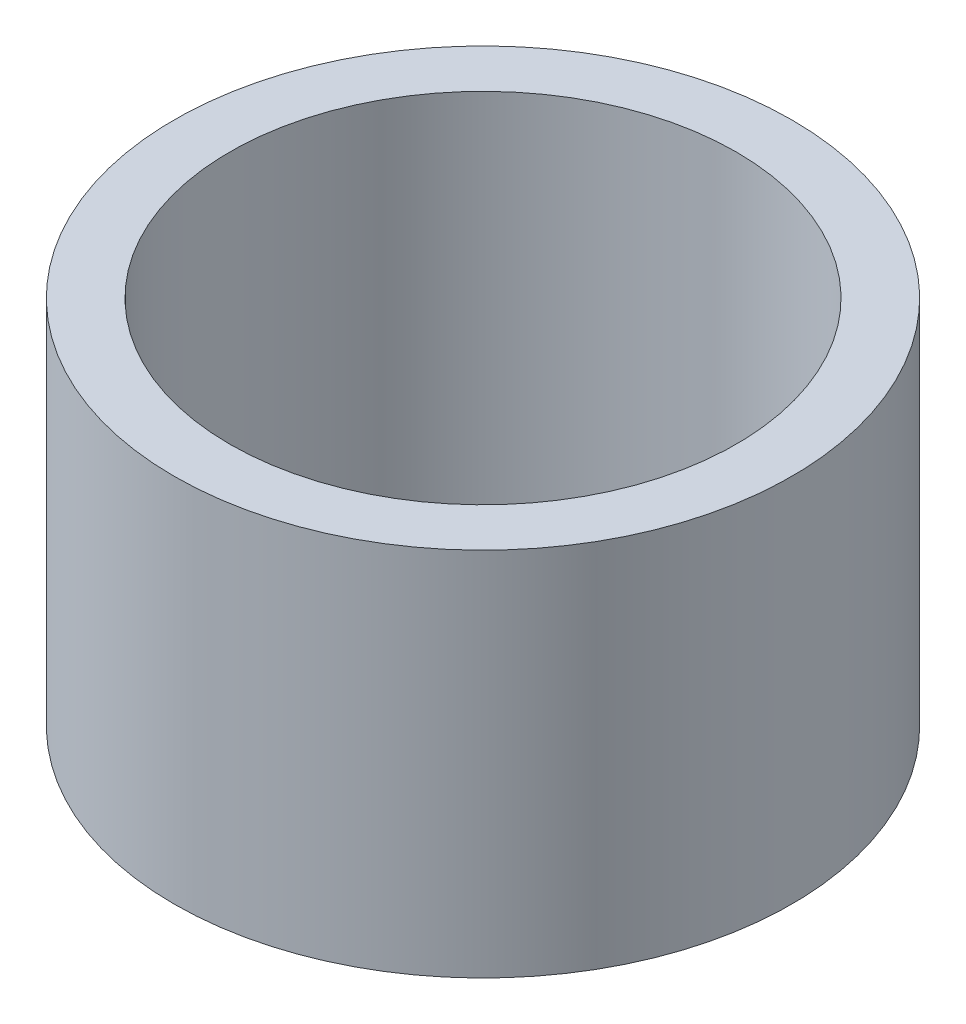
ISO-10303-21;
HEADER;
FILE_DESCRIPTION(('STEP AP214'),'2;1');
FILE_NAME('part.step','',(''),(''),'','','');
FILE_SCHEMA(('AUTOMOTIVE_DESIGN { 1 0 10303 214 1 1 1 1 }'));
ENDSEC;
DATA;
#1=APPLICATION_CONTEXT('core data for automotive mechanical design processes');
#2=APPLICATION_PROTOCOL_DEFINITION('international standard','automotive_design',2000,#1);
#3=PRODUCT_CONTEXT('',#1,'mechanical');
#4=PRODUCT('Part','Part','',(#3));
#5=PRODUCT_RELATED_PRODUCT_CATEGORY('part','',(#4));
#6=PRODUCT_DEFINITION_FORMATION('','',#4);
#7=PRODUCT_DEFINITION_CONTEXT('part definition',#1,'design');
#8=PRODUCT_DEFINITION('design','',#6,#7);
#9=PRODUCT_DEFINITION_SHAPE('','',#8);
#10=(LENGTH_UNIT() NAMED_UNIT(*) SI_UNIT(.MILLI.,.METRE.));
#11=(NAMED_UNIT(*) PLANE_ANGLE_UNIT() SI_UNIT($,.RADIAN.));
#12=(NAMED_UNIT(*) SI_UNIT($,.STERADIAN.) SOLID_ANGLE_UNIT());
#13=UNCERTAINTY_MEASURE_WITH_UNIT(LENGTH_MEASURE(1.E-05),#10,'distance_accuracy_value','');
#14=(GEOMETRIC_REPRESENTATION_CONTEXT(3) GLOBAL_UNCERTAINTY_ASSIGNED_CONTEXT((#13)) GLOBAL_UNIT_ASSIGNED_CONTEXT((#10,
#11,#12)) REPRESENTATION_CONTEXT('',''));
#15=CARTESIAN_POINT('',(0.,0.,0.));
#16=DIRECTION('',(0.,0.,1.));
#17=DIRECTION('',(1.,0.,0.));
#18=AXIS2_PLACEMENT_3D('',#15,#16,#17);
#19=CARTESIAN_POINT('',(0.,3.,0.));
#20=DIRECTION('',(0.,-1.,0.));
#21=DIRECTION('',(0.,0.,-1.));
#22=AXIS2_PLACEMENT_3D('',#19,#20,#21);
#23=CYLINDRICAL_SURFACE('',#22,2.5);
#24=CARTESIAN_POINT('',(0.,3.,0.));
#25=DIRECTION('',(0.,1.,0.));
#26=DIRECTION('',(0.,0.,1.));
#27=AXIS2_PLACEMENT_3D('',#24,#25,#26);
#28=CIRCLE('',#27,2.5);
#29=CARTESIAN_POINT('',(0.,3.,2.5));
#30=VERTEX_POINT('',#29);
#31=EDGE_CURVE('E10',#30,#30,#28,.T.);
#32=ORIENTED_EDGE('',*,*,#31,.F.);
#33=EDGE_LOOP('',(#32));
#34=FACE_BOUND('',#33,.T.);
#35=CARTESIAN_POINT('',(0.,0.,0.));
#36=DIRECTION('',(0.,1.,0.));
#37=DIRECTION('',(0.,0.,1.));
#38=AXIS2_PLACEMENT_3D('',#35,#36,#37);
#39=CIRCLE('',#38,2.5);
#40=CARTESIAN_POINT('',(0.,0.,2.5));
#41=VERTEX_POINT('',#40);
#42=EDGE_CURVE('E45',#41,#41,#39,.T.);
#43=ORIENTED_EDGE('',*,*,#42,.T.);
#44=EDGE_LOOP('',(#43));
#45=FACE_BOUND('',#44,.T.);
#46=ADVANCED_FACE('F37',(#34,#45),#23,.T.);
#47=CARTESIAN_POINT('',(0.,3.,0.));
#48=DIRECTION('',(0.,1.,0.));
#49=DIRECTION('',(0.,0.,1.));
#50=AXIS2_PLACEMENT_3D('',#47,#48,#49);
#51=PLANE('',#50);
#52=CARTESIAN_POINT('',(0.,3.,0.));
#53=DIRECTION('',(0.,1.,0.));
#54=DIRECTION('',(0.,0.,1.));
#55=AXIS2_PLACEMENT_3D('',#52,#53,#54);
#56=CIRCLE('',#55,2.05);
#57=CARTESIAN_POINT('',(0.,3.,2.05));
#58=VERTEX_POINT('',#57);
#59=EDGE_CURVE('E52',#58,#58,#56,.T.);
#60=ORIENTED_EDGE('',*,*,#59,.F.);
#61=EDGE_LOOP('',(#60));
#62=FACE_BOUND('',#61,.T.);
#63=ORIENTED_EDGE('',*,*,#31,.T.);
#64=EDGE_LOOP('',(#63));
#65=FACE_BOUND('',#64,.T.);
#66=ADVANCED_FACE('F70',(#62,#65),#51,.T.);
#67=CARTESIAN_POINT('',(0.,0.,0.));
#68=DIRECTION('',(0.,1.,0.));
#69=DIRECTION('',(0.,0.,1.));
#70=AXIS2_PLACEMENT_3D('',#67,#68,#69);
#71=PLANE('',#70);
#72=CARTESIAN_POINT('',(0.,0.,0.));
#73=DIRECTION('',(0.,1.,0.));
#74=DIRECTION('',(0.,0.,1.));
#75=AXIS2_PLACEMENT_3D('',#72,#73,#74);
#76=CIRCLE('',#75,2.05);
#77=CARTESIAN_POINT('',(0.,0.,2.05));
#78=VERTEX_POINT('',#77);
#79=EDGE_CURVE('E40',#78,#78,#76,.T.);
#80=ORIENTED_EDGE('',*,*,#79,.T.);
#81=EDGE_LOOP('',(#80));
#82=FACE_BOUND('',#81,.T.);
#83=ORIENTED_EDGE('',*,*,#42,.F.);
#84=EDGE_LOOP('',(#83));
#85=FACE_BOUND('',#84,.T.);
#86=ADVANCED_FACE('F61',(#82,#85),#71,.F.);
#87=CARTESIAN_POINT('',(0.,-2.,0.));
#88=DIRECTION('',(0.,1.,0.));
#89=DIRECTION('',(0.,0.,1.));
#90=AXIS2_PLACEMENT_3D('',#87,#88,#89);
#91=CYLINDRICAL_SURFACE('',#90,2.05);
#92=ORIENTED_EDGE('',*,*,#59,.T.);
#93=EDGE_LOOP('',(#92));
#94=FACE_BOUND('',#93,.T.);
#95=ORIENTED_EDGE('',*,*,#79,.F.);
#96=EDGE_LOOP('',(#95));
#97=FACE_BOUND('',#96,.T.);
#98=ADVANCED_FACE('F64',(#94,#97),#91,.F.);
#99=CLOSED_SHELL('',(#46,#66,#86,#98));
#100=MANIFOLD_SOLID_BREP('B2',#99);
#101=ADVANCED_BREP_SHAPE_REPRESENTATION('',(#18,#100),#14);
#102=SHAPE_DEFINITION_REPRESENTATION(#9,#101);
ENDSEC;
END-ISO-10303-21;
